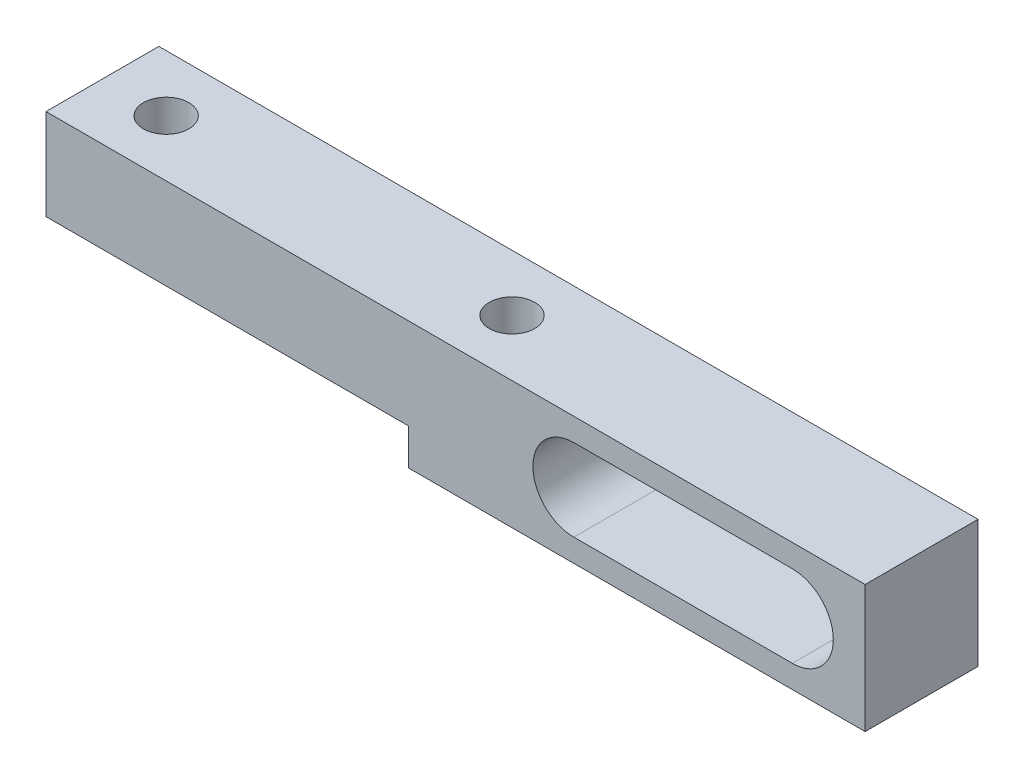
ISO-10303-21;
HEADER;
FILE_DESCRIPTION(('STEP AP214'),'2;1');
FILE_NAME('part.step','',(''),(''),'','','');
FILE_SCHEMA(('AUTOMOTIVE_DESIGN { 1 0 10303 214 1 1 1 1 }'));
ENDSEC;
DATA;
#1=APPLICATION_CONTEXT('core data for automotive mechanical design processes');
#2=APPLICATION_PROTOCOL_DEFINITION('international standard','automotive_design',2000,#1);
#3=PRODUCT_CONTEXT('',#1,'mechanical');
#4=PRODUCT('Part','Part','',(#3));
#5=PRODUCT_RELATED_PRODUCT_CATEGORY('part','',(#4));
#6=PRODUCT_DEFINITION_FORMATION('','',#4);
#7=PRODUCT_DEFINITION_CONTEXT('part definition',#1,'design');
#8=PRODUCT_DEFINITION('design','',#6,#7);
#9=PRODUCT_DEFINITION_SHAPE('','',#8);
#10=(LENGTH_UNIT() NAMED_UNIT(*) SI_UNIT(.MILLI.,.METRE.));
#11=(NAMED_UNIT(*) PLANE_ANGLE_UNIT() SI_UNIT($,.RADIAN.));
#12=(NAMED_UNIT(*) SI_UNIT($,.STERADIAN.) SOLID_ANGLE_UNIT());
#13=UNCERTAINTY_MEASURE_WITH_UNIT(LENGTH_MEASURE(1.E-05),#10,'distance_accuracy_value','');
#14=(GEOMETRIC_REPRESENTATION_CONTEXT(3) GLOBAL_UNCERTAINTY_ASSIGNED_CONTEXT((#13)) GLOBAL_UNIT_ASSIGNED_CONTEXT((#10,
#11,#12)) REPRESENTATION_CONTEXT('',''));
#15=CARTESIAN_POINT('',(0.,0.,0.));
#16=DIRECTION('',(0.,0.,1.));
#17=DIRECTION('',(1.,0.,0.));
#18=AXIS2_PLACEMENT_3D('',#15,#16,#17);
#19=CARTESIAN_POINT('',(0.,0.,6.2));
#20=DIRECTION('',(0.,0.,1.));
#21=DIRECTION('',(1.,0.,0.));
#22=AXIS2_PLACEMENT_3D('',#19,#20,#21);
#23=PLANE('',#22);
#24=DIRECTION('',(0.,1.,0.));
#25=VECTOR('',#24,1.);
#26=CARTESIAN_POINT('',(44.9999999999999,-2.,6.2));
#27=LINE('',#26,#25);
#28=CARTESIAN_POINT('',(44.9999999999999,-2.,6.2));
#29=VERTEX_POINT('',#28);
#30=CARTESIAN_POINT('',(44.9999999999999,5.,6.2));
#31=VERTEX_POINT('',#30);
#32=EDGE_CURVE('E152',#29,#31,#27,.T.);
#33=ORIENTED_EDGE('',*,*,#32,.T.);
#34=DIRECTION('',(-1.,0.,0.));
#35=VECTOR('',#34,1.);
#36=CARTESIAN_POINT('',(44.9999999999999,5.,6.2));
#37=LINE('',#36,#35);
#38=CARTESIAN_POINT('',(0.,5.,6.2));
#39=VERTEX_POINT('',#38);
#40=EDGE_CURVE('E155',#31,#39,#37,.T.);
#41=ORIENTED_EDGE('',*,*,#40,.T.);
#42=DIRECTION('',(0.,-1.,0.));
#43=VECTOR('',#42,1.);
#44=CARTESIAN_POINT('',(0.,0.,6.2));
#45=LINE('',#44,#43);
#46=CARTESIAN_POINT('',(0.,0.,6.2));
#47=VERTEX_POINT('',#46);
#48=EDGE_CURVE('E158',#39,#47,#45,.T.);
#49=ORIENTED_EDGE('',*,*,#48,.T.);
#50=DIRECTION('',(1.,0.,0.));
#51=VECTOR('',#50,1.);
#52=CARTESIAN_POINT('',(19.9247875583604,0.,6.2));
#53=LINE('',#52,#51);
#54=CARTESIAN_POINT('',(19.9247875583604,0.,6.2));
#55=VERTEX_POINT('',#54);
#56=EDGE_CURVE('E160',#47,#55,#53,.T.);
#57=ORIENTED_EDGE('',*,*,#56,.T.);
#58=DIRECTION('',(0.,-1.,0.));
#59=VECTOR('',#58,1.);
#60=CARTESIAN_POINT('',(19.9247875583604,0.,6.2));
#61=LINE('',#60,#59);
#62=CARTESIAN_POINT('',(19.9247875583604,-2.,6.2));
#63=VERTEX_POINT('',#62);
#64=EDGE_CURVE('E162',#55,#63,#61,.T.);
#65=ORIENTED_EDGE('',*,*,#64,.T.);
#66=DIRECTION('',(1.,0.,0.));
#67=VECTOR('',#66,1.);
#68=CARTESIAN_POINT('',(19.9247875583604,-2.,6.2));
#69=LINE('',#68,#67);
#70=EDGE_CURVE('E164',#63,#29,#69,.T.);
#71=ORIENTED_EDGE('',*,*,#70,.T.);
#72=EDGE_LOOP('',(#33,#41,#49,#57,#65,#71));
#73=FACE_BOUND('',#72,.T.);
#74=DIRECTION('',(1.,0.,0.));
#75=VECTOR('',#74,1.);
#76=CARTESIAN_POINT('',(28.9999999999999,-0.750000000000028,6.2));
#77=LINE('',#76,#75);
#78=CARTESIAN_POINT('',(28.9999999999999,-0.750000000000028,6.2));
#79=VERTEX_POINT('',#78);
#80=CARTESIAN_POINT('',(40.9999999999995,-0.750000000000028,6.2));
#81=VERTEX_POINT('',#80);
#82=EDGE_CURVE('E122',#79,#81,#77,.T.);
#83=ORIENTED_EDGE('',*,*,#82,.F.);
#84=CARTESIAN_POINT('',(28.9999999999999,1.5,6.2));
#85=DIRECTION('',(0.,0.,1.));
#86=DIRECTION('',(1.,0.,0.));
#87=AXIS2_PLACEMENT_3D('',#84,#85,#86);
#88=CIRCLE('',#87,2.25);
#89=CARTESIAN_POINT('',(28.9999999999999,3.74999999999998,6.2));
#90=VERTEX_POINT('',#89);
#91=EDGE_CURVE('E114',#90,#79,#88,.T.);
#92=ORIENTED_EDGE('',*,*,#91,.F.);
#93=DIRECTION('',(-1.,0.,0.));
#94=VECTOR('',#93,1.);
#95=CARTESIAN_POINT('',(40.9999999999995,3.74999999999998,6.2));
#96=LINE('',#95,#94);
#97=CARTESIAN_POINT('',(40.9999999999995,3.74999999999998,6.2));
#98=VERTEX_POINT('',#97);
#99=EDGE_CURVE('E136',#98,#90,#96,.T.);
#100=ORIENTED_EDGE('',*,*,#99,.F.);
#101=CARTESIAN_POINT('',(40.9999999999995,1.5,6.2));
#102=DIRECTION('',(0.,0.,1.));
#103=DIRECTION('',(1.,0.,0.));
#104=AXIS2_PLACEMENT_3D('',#101,#102,#103);
#105=CIRCLE('',#104,2.25);
#106=EDGE_CURVE('E134',#81,#98,#105,.T.);
#107=ORIENTED_EDGE('',*,*,#106,.F.);
#108=EDGE_LOOP('',(#83,#92,#100,#107));
#109=FACE_BOUND('',#108,.T.);
#110=ADVANCED_FACE('F37',(#73,#109),#23,.T.);
#111=CARTESIAN_POINT('',(0.,0.,0.));
#112=DIRECTION('',(0.,0.,1.));
#113=DIRECTION('',(1.,0.,0.));
#114=AXIS2_PLACEMENT_3D('',#111,#112,#113);
#115=PLANE('',#114);
#116=DIRECTION('',(0.,1.,0.));
#117=VECTOR('',#116,1.);
#118=CARTESIAN_POINT('',(44.9999999999999,-2.,0.));
#119=LINE('',#118,#117);
#120=CARTESIAN_POINT('',(44.9999999999999,-2.,0.));
#121=VERTEX_POINT('',#120);
#122=CARTESIAN_POINT('',(44.9999999999999,5.,0.));
#123=VERTEX_POINT('',#122);
#124=EDGE_CURVE('E130',#121,#123,#119,.T.);
#125=ORIENTED_EDGE('',*,*,#124,.F.);
#126=DIRECTION('',(1.,0.,0.));
#127=VECTOR('',#126,1.);
#128=CARTESIAN_POINT('',(19.9247875583604,-2.,0.));
#129=LINE('',#128,#127);
#130=CARTESIAN_POINT('',(19.9247875583604,-2.,0.));
#131=VERTEX_POINT('',#130);
#132=EDGE_CURVE('E156',#131,#121,#129,.T.);
#133=ORIENTED_EDGE('',*,*,#132,.F.);
#134=DIRECTION('',(0.,-1.,0.));
#135=VECTOR('',#134,1.);
#136=CARTESIAN_POINT('',(19.9247875583604,0.,0.));
#137=LINE('',#136,#135);
#138=CARTESIAN_POINT('',(19.9247875583604,0.,0.));
#139=VERTEX_POINT('',#138);
#140=EDGE_CURVE('E175',#139,#131,#137,.T.);
#141=ORIENTED_EDGE('',*,*,#140,.F.);
#142=DIRECTION('',(1.,0.,0.));
#143=VECTOR('',#142,1.);
#144=CARTESIAN_POINT('',(19.9247875583604,0.,0.));
#145=LINE('',#144,#143);
#146=CARTESIAN_POINT('',(0.,0.,0.));
#147=VERTEX_POINT('',#146);
#148=EDGE_CURVE('E173',#147,#139,#145,.T.);
#149=ORIENTED_EDGE('',*,*,#148,.F.);
#150=DIRECTION('',(0.,-1.,0.));
#151=VECTOR('',#150,1.);
#152=CARTESIAN_POINT('',(0.,0.,0.));
#153=LINE('',#152,#151);
#154=CARTESIAN_POINT('',(0.,5.,0.));
#155=VERTEX_POINT('',#154);
#156=EDGE_CURVE('E171',#155,#147,#153,.T.);
#157=ORIENTED_EDGE('',*,*,#156,.F.);
#158=DIRECTION('',(-1.,0.,0.));
#159=VECTOR('',#158,1.);
#160=CARTESIAN_POINT('',(44.9999999999999,5.,0.));
#161=LINE('',#160,#159);
#162=EDGE_CURVE('E169',#123,#155,#161,.T.);
#163=ORIENTED_EDGE('',*,*,#162,.F.);
#164=EDGE_LOOP('',(#125,#133,#141,#149,#157,#163));
#165=FACE_BOUND('',#164,.T.);
#166=CARTESIAN_POINT('',(28.9999999999999,1.5,0.));
#167=DIRECTION('',(0.,0.,1.));
#168=DIRECTION('',(1.,0.,0.));
#169=AXIS2_PLACEMENT_3D('',#166,#167,#168);
#170=CIRCLE('',#169,2.25);
#171=CARTESIAN_POINT('',(28.9999999999999,3.74999999999998,0.));
#172=VERTEX_POINT('',#171);
#173=CARTESIAN_POINT('',(28.9999999999999,-0.750000000000028,0.));
#174=VERTEX_POINT('',#173);
#175=EDGE_CURVE('E60',#172,#174,#170,.T.);
#176=ORIENTED_EDGE('',*,*,#175,.T.);
#177=DIRECTION('',(1.,0.,0.));
#178=VECTOR('',#177,1.);
#179=CARTESIAN_POINT('',(28.9999999999999,-0.750000000000028,0.));
#180=LINE('',#179,#178);
#181=CARTESIAN_POINT('',(40.9999999999995,-0.750000000000028,0.));
#182=VERTEX_POINT('',#181);
#183=EDGE_CURVE('E129',#174,#182,#180,.T.);
#184=ORIENTED_EDGE('',*,*,#183,.T.);
#185=CARTESIAN_POINT('',(40.9999999999995,1.5,0.));
#186=DIRECTION('',(0.,0.,1.));
#187=DIRECTION('',(1.,0.,0.));
#188=AXIS2_PLACEMENT_3D('',#185,#186,#187);
#189=CIRCLE('',#188,2.25);
#190=CARTESIAN_POINT('',(40.9999999999995,3.75,0.));
#191=VERTEX_POINT('',#190);
#192=EDGE_CURVE('E144',#182,#191,#189,.T.);
#193=ORIENTED_EDGE('',*,*,#192,.T.);
#194=DIRECTION('',(-1.,0.,0.));
#195=VECTOR('',#194,1.);
#196=CARTESIAN_POINT('',(40.9999999999995,3.74999999999998,0.));
#197=LINE('',#196,#195);
#198=EDGE_CURVE('E123',#191,#172,#197,.T.);
#199=ORIENTED_EDGE('',*,*,#198,.T.);
#200=EDGE_LOOP('',(#176,#184,#193,#199));
#201=FACE_BOUND('',#200,.T.);
#202=ADVANCED_FACE('F199',(#165,#201),#115,.F.);
#203=CARTESIAN_POINT('',(44.9999999999999,-2.,6.2));
#204=DIRECTION('',(-1.,0.,0.));
#205=DIRECTION('',(0.,0.,1.));
#206=AXIS2_PLACEMENT_3D('',#203,#204,#205);
#207=PLANE('',#206);
#208=ORIENTED_EDGE('',*,*,#124,.T.);
#209=DIRECTION('',(0.,0.,-1.));
#210=VECTOR('',#209,1.);
#211=CARTESIAN_POINT('',(44.9999999999999,5.,6.2));
#212=LINE('',#211,#210);
#213=EDGE_CURVE('E11',#31,#123,#212,.T.);
#214=ORIENTED_EDGE('',*,*,#213,.F.);
#215=ORIENTED_EDGE('',*,*,#32,.F.);
#216=DIRECTION('',(0.,0.,-1.));
#217=VECTOR('',#216,1.);
#218=CARTESIAN_POINT('',(44.9999999999999,-2.,6.2));
#219=LINE('',#218,#217);
#220=EDGE_CURVE('E166',#29,#121,#219,.T.);
#221=ORIENTED_EDGE('',*,*,#220,.T.);
#222=EDGE_LOOP('',(#208,#214,#215,#221));
#223=FACE_BOUND('',#222,.T.);
#224=ADVANCED_FACE('F39',(#223),#207,.F.);
#225=CARTESIAN_POINT('',(44.9999999999999,5.,6.2));
#226=DIRECTION('',(0.,-1.,0.));
#227=DIRECTION('',(0.,0.,-1.));
#228=AXIS2_PLACEMENT_3D('',#225,#226,#227);
#229=PLANE('',#228);
#230=CARTESIAN_POINT('',(22.4999999999999,5.,3.1));
#231=DIRECTION('',(0.,-1.,0.));
#232=DIRECTION('',(0.,0.,-1.));
#233=AXIS2_PLACEMENT_3D('',#230,#231,#232);
#234=CIRCLE('',#233,1.25);
#235=CARTESIAN_POINT('',(22.4999999999999,5.,1.85));
#236=VERTEX_POINT('',#235);
#237=EDGE_CURVE('E258',#236,#236,#234,.T.);
#238=ORIENTED_EDGE('',*,*,#237,.T.);
#239=EDGE_LOOP('',(#238));
#240=FACE_BOUND('',#239,.T.);
#241=CARTESIAN_POINT('',(3.49999999999993,5.,3.1));
#242=DIRECTION('',(0.,-1.,0.));
#243=DIRECTION('',(0.,0.,-1.));
#244=AXIS2_PLACEMENT_3D('',#241,#242,#243);
#245=CIRCLE('',#244,1.25);
#246=CARTESIAN_POINT('',(3.49999999999993,5.,1.85));
#247=VERTEX_POINT('',#246);
#248=EDGE_CURVE('E262',#247,#247,#245,.T.);
#249=ORIENTED_EDGE('',*,*,#248,.T.);
#250=EDGE_LOOP('',(#249));
#251=FACE_BOUND('',#250,.T.);
#252=ORIENTED_EDGE('',*,*,#162,.T.);
#253=DIRECTION('',(0.,0.,-1.));
#254=VECTOR('',#253,1.);
#255=CARTESIAN_POINT('',(0.,5.,6.2));
#256=LINE('',#255,#254);
#257=EDGE_CURVE('E45',#39,#155,#256,.T.);
#258=ORIENTED_EDGE('',*,*,#257,.F.);
#259=ORIENTED_EDGE('',*,*,#40,.F.);
#260=ORIENTED_EDGE('',*,*,#213,.T.);
#261=EDGE_LOOP('',(#252,#258,#259,#260));
#262=FACE_BOUND('',#261,.T.);
#263=ADVANCED_FACE('F216',(#240,#251,#262),#229,.F.);
#264=CARTESIAN_POINT('',(0.,0.,6.2));
#265=DIRECTION('',(1.,0.,0.));
#266=DIRECTION('',(0.,0.,-1.));
#267=AXIS2_PLACEMENT_3D('',#264,#265,#266);
#268=PLANE('',#267);
#269=ORIENTED_EDGE('',*,*,#156,.T.);
#270=DIRECTION('',(0.,0.,-1.));
#271=VECTOR('',#270,1.);
#272=CARTESIAN_POINT('',(0.,0.,6.2));
#273=LINE('',#272,#271);
#274=EDGE_CURVE('E186',#47,#147,#273,.T.);
#275=ORIENTED_EDGE('',*,*,#274,.F.);
#276=ORIENTED_EDGE('',*,*,#48,.F.);
#277=ORIENTED_EDGE('',*,*,#257,.T.);
#278=EDGE_LOOP('',(#269,#275,#276,#277));
#279=FACE_BOUND('',#278,.T.);
#280=ADVANCED_FACE('F193',(#279),#268,.F.);
#281=CARTESIAN_POINT('',(19.9247875583604,0.,6.2));
#282=DIRECTION('',(0.,1.,0.));
#283=DIRECTION('',(0.,0.,1.));
#284=AXIS2_PLACEMENT_3D('',#281,#282,#283);
#285=PLANE('',#284);
#286=CARTESIAN_POINT('',(3.49999999999993,0.,3.1));
#287=DIRECTION('',(0.,1.,0.));
#288=DIRECTION('',(0.,0.,1.));
#289=AXIS2_PLACEMENT_3D('',#286,#287,#288);
#290=CIRCLE('',#289,1.24999999999999);
#291=CARTESIAN_POINT('',(3.49999999999993,0.,4.34999999999999));
#292=VERTEX_POINT('',#291);
#293=EDGE_CURVE('E142',#292,#292,#290,.T.);
#294=ORIENTED_EDGE('',*,*,#293,.T.);
#295=EDGE_LOOP('',(#294));
#296=FACE_BOUND('',#295,.T.);
#297=ORIENTED_EDGE('',*,*,#148,.T.);
#298=DIRECTION('',(0.,0.,-1.));
#299=VECTOR('',#298,1.);
#300=CARTESIAN_POINT('',(19.9247875583604,0.,6.2));
#301=LINE('',#300,#299);
#302=EDGE_CURVE('E183',#55,#139,#301,.T.);
#303=ORIENTED_EDGE('',*,*,#302,.F.);
#304=ORIENTED_EDGE('',*,*,#56,.F.);
#305=ORIENTED_EDGE('',*,*,#274,.T.);
#306=EDGE_LOOP('',(#297,#303,#304,#305));
#307=FACE_BOUND('',#306,.T.);
#308=ADVANCED_FACE('F205',(#296,#307),#285,.F.);
#309=CARTESIAN_POINT('',(19.9247875583604,0.,6.2));
#310=DIRECTION('',(1.,0.,0.));
#311=DIRECTION('',(0.,0.,-1.));
#312=AXIS2_PLACEMENT_3D('',#309,#310,#311);
#313=PLANE('',#312);
#314=ORIENTED_EDGE('',*,*,#140,.T.);
#315=DIRECTION('',(0.,0.,-1.));
#316=VECTOR('',#315,1.);
#317=CARTESIAN_POINT('',(19.9247875583604,-2.,6.2));
#318=LINE('',#317,#316);
#319=EDGE_CURVE('E180',#63,#131,#318,.T.);
#320=ORIENTED_EDGE('',*,*,#319,.F.);
#321=ORIENTED_EDGE('',*,*,#64,.F.);
#322=ORIENTED_EDGE('',*,*,#302,.T.);
#323=EDGE_LOOP('',(#314,#320,#321,#322));
#324=FACE_BOUND('',#323,.T.);
#325=ADVANCED_FACE('F209',(#324),#313,.F.);
#326=CARTESIAN_POINT('',(19.9247875583604,-2.,6.2));
#327=DIRECTION('',(0.,1.,0.));
#328=DIRECTION('',(0.,0.,1.));
#329=AXIS2_PLACEMENT_3D('',#326,#327,#328);
#330=PLANE('',#329);
#331=CARTESIAN_POINT('',(22.4999999999999,-2.,3.1));
#332=DIRECTION('',(0.,-1.,0.));
#333=DIRECTION('',(0.,0.,-1.));
#334=AXIS2_PLACEMENT_3D('',#331,#332,#333);
#335=CIRCLE('',#334,1.24999999999999);
#336=CARTESIAN_POINT('',(22.4999999999999,-2.,1.85000000000001));
#337=VERTEX_POINT('',#336);
#338=EDGE_CURVE('E260',#337,#337,#335,.T.);
#339=ORIENTED_EDGE('',*,*,#338,.F.);
#340=EDGE_LOOP('',(#339));
#341=FACE_BOUND('',#340,.T.);
#342=ORIENTED_EDGE('',*,*,#132,.T.);
#343=ORIENTED_EDGE('',*,*,#220,.F.);
#344=ORIENTED_EDGE('',*,*,#70,.F.);
#345=ORIENTED_EDGE('',*,*,#319,.T.);
#346=EDGE_LOOP('',(#342,#343,#344,#345));
#347=FACE_BOUND('',#346,.T.);
#348=ADVANCED_FACE('F219',(#341,#347),#330,.F.);
#349=CARTESIAN_POINT('',(28.9999999999999,1.5,6.2));
#350=DIRECTION('',(0.,0.,-1.));
#351=DIRECTION('',(-1.,0.,0.));
#352=AXIS2_PLACEMENT_3D('',#349,#350,#351);
#353=CYLINDRICAL_SURFACE('',#352,2.25);
#354=ORIENTED_EDGE('',*,*,#175,.F.);
#355=DIRECTION('',(0.,0.,-1.));
#356=VECTOR('',#355,1.);
#357=CARTESIAN_POINT('',(28.9999999999999,3.74999999999998,6.2));
#358=LINE('',#357,#356);
#359=EDGE_CURVE('E118',#90,#172,#358,.T.);
#360=ORIENTED_EDGE('',*,*,#359,.F.);
#361=ORIENTED_EDGE('',*,*,#91,.T.);
#362=DIRECTION('',(0.,0.,-1.));
#363=VECTOR('',#362,1.);
#364=CARTESIAN_POINT('',(28.9999999999999,-0.750000000000028,6.2));
#365=LINE('',#364,#363);
#366=EDGE_CURVE('E117',#79,#174,#365,.T.);
#367=ORIENTED_EDGE('',*,*,#366,.T.);
#368=EDGE_LOOP('',(#354,#360,#361,#367));
#369=FACE_BOUND('',#368,.T.);
#370=ADVANCED_FACE('F116',(#369),#353,.F.);
#371=CARTESIAN_POINT('',(28.9999999999999,-0.750000000000028,6.2));
#372=DIRECTION('',(0.,1.,0.));
#373=DIRECTION('',(0.,0.,1.));
#374=AXIS2_PLACEMENT_3D('',#371,#372,#373);
#375=PLANE('',#374);
#376=ORIENTED_EDGE('',*,*,#183,.F.);
#377=ORIENTED_EDGE('',*,*,#366,.F.);
#378=ORIENTED_EDGE('',*,*,#82,.T.);
#379=DIRECTION('',(0.,0.,-1.));
#380=VECTOR('',#379,1.);
#381=CARTESIAN_POINT('',(40.9999999999995,-0.750000000000028,6.2));
#382=LINE('',#381,#380);
#383=EDGE_CURVE('E131',#81,#182,#382,.T.);
#384=ORIENTED_EDGE('',*,*,#383,.T.);
#385=EDGE_LOOP('',(#376,#377,#378,#384));
#386=FACE_BOUND('',#385,.T.);
#387=ADVANCED_FACE('F126',(#386),#375,.T.);
#388=CARTESIAN_POINT('',(40.9999999999995,1.5,6.2));
#389=DIRECTION('',(0.,0.,-1.));
#390=DIRECTION('',(-1.,0.,0.));
#391=AXIS2_PLACEMENT_3D('',#388,#389,#390);
#392=CYLINDRICAL_SURFACE('',#391,2.25);
#393=ORIENTED_EDGE('',*,*,#192,.F.);
#394=ORIENTED_EDGE('',*,*,#383,.F.);
#395=ORIENTED_EDGE('',*,*,#106,.T.);
#396=DIRECTION('',(0.,0.,-1.));
#397=VECTOR('',#396,1.);
#398=CARTESIAN_POINT('',(40.9999999999995,3.75,6.2));
#399=LINE('',#398,#397);
#400=EDGE_CURVE('E52',#98,#191,#399,.T.);
#401=ORIENTED_EDGE('',*,*,#400,.T.);
#402=EDGE_LOOP('',(#393,#394,#395,#401));
#403=FACE_BOUND('',#402,.T.);
#404=ADVANCED_FACE('F239',(#403),#392,.F.);
#405=CARTESIAN_POINT('',(40.9999999999995,3.74999999999998,6.2));
#406=DIRECTION('',(0.,-1.,0.));
#407=DIRECTION('',(0.,0.,-1.));
#408=AXIS2_PLACEMENT_3D('',#405,#406,#407);
#409=PLANE('',#408);
#410=ORIENTED_EDGE('',*,*,#198,.F.);
#411=ORIENTED_EDGE('',*,*,#400,.F.);
#412=ORIENTED_EDGE('',*,*,#99,.T.);
#413=ORIENTED_EDGE('',*,*,#359,.T.);
#414=EDGE_LOOP('',(#410,#411,#412,#413));
#415=FACE_BOUND('',#414,.T.);
#416=ADVANCED_FACE('F242',(#415),#409,.T.);
#417=CARTESIAN_POINT('',(3.49999999999993,-2.,3.1));
#418=DIRECTION('',(0.,-1.,0.));
#419=DIRECTION('',(0.,0.,-1.));
#420=AXIS2_PLACEMENT_3D('',#417,#418,#419);
#421=CYLINDRICAL_SURFACE('',#420,1.24999999999999);
#422=ORIENTED_EDGE('',*,*,#248,.F.);
#423=EDGE_LOOP('',(#422));
#424=FACE_BOUND('',#423,.T.);
#425=ORIENTED_EDGE('',*,*,#293,.F.);
#426=EDGE_LOOP('',(#425));
#427=FACE_BOUND('',#426,.T.);
#428=ADVANCED_FACE('F246',(#424,#427),#421,.F.);
#429=CARTESIAN_POINT('',(22.4999999999999,-2.,3.1));
#430=DIRECTION('',(0.,-1.,0.));
#431=DIRECTION('',(0.,0.,-1.));
#432=AXIS2_PLACEMENT_3D('',#429,#430,#431);
#433=CYLINDRICAL_SURFACE('',#432,1.24999999999999);
#434=ORIENTED_EDGE('',*,*,#237,.F.);
#435=EDGE_LOOP('',(#434));
#436=FACE_BOUND('',#435,.T.);
#437=ORIENTED_EDGE('',*,*,#338,.T.);
#438=EDGE_LOOP('',(#437));
#439=FACE_BOUND('',#438,.T.);
#440=ADVANCED_FACE('F249',(#436,#439),#433,.F.);
#441=CLOSED_SHELL('',(#110,#202,#224,#263,#280,#308,#325,#348,#370,#387,#404,#416,#428,#440));
#442=MANIFOLD_SOLID_BREP('B2',#441);
#443=ADVANCED_BREP_SHAPE_REPRESENTATION('',(#18,#442),#14);
#444=SHAPE_DEFINITION_REPRESENTATION(#9,#443);
ENDSEC;
END-ISO-10303-21;
